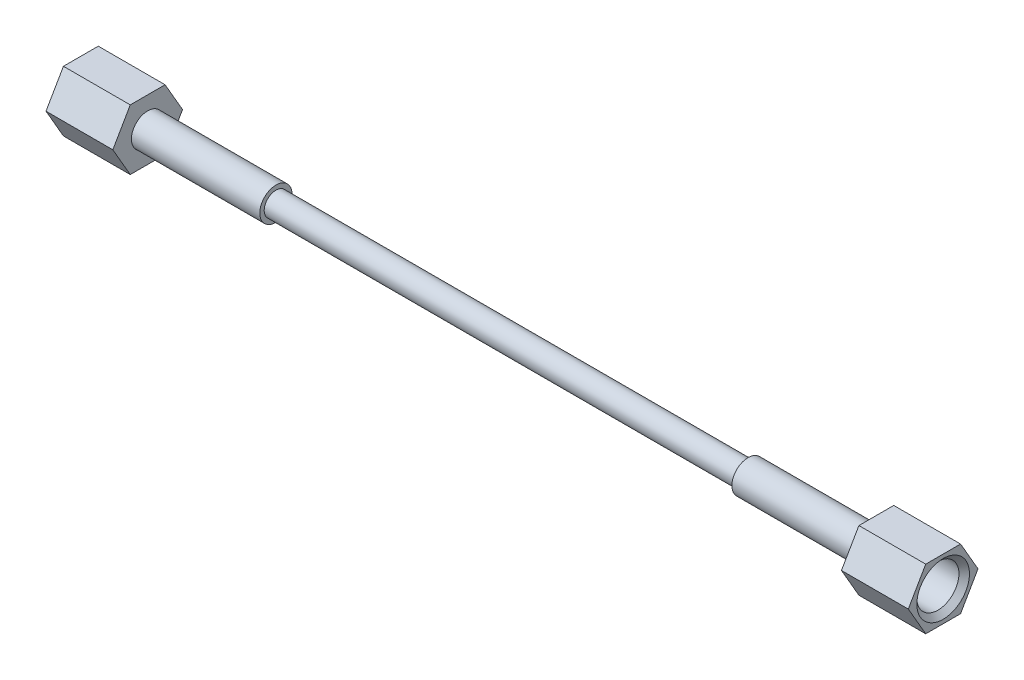
ISO-10303-21;
HEADER;
FILE_DESCRIPTION(('STEP AP214'),'2;1');
FILE_NAME('part.step','',(''),(''),'','','');
FILE_SCHEMA(('AUTOMOTIVE_DESIGN { 1 0 10303 214 1 1 1 1 }'));
ENDSEC;
DATA;
#1=APPLICATION_CONTEXT('core data for automotive mechanical design processes');
#2=APPLICATION_PROTOCOL_DEFINITION('international standard','automotive_design',2000,#1);
#3=PRODUCT_CONTEXT('',#1,'mechanical');
#4=PRODUCT('Part','Part','',(#3));
#5=PRODUCT_RELATED_PRODUCT_CATEGORY('part','',(#4));
#6=PRODUCT_DEFINITION_FORMATION('','',#4);
#7=PRODUCT_DEFINITION_CONTEXT('part definition',#1,'design');
#8=PRODUCT_DEFINITION('design','',#6,#7);
#9=PRODUCT_DEFINITION_SHAPE('','',#8);
#10=(LENGTH_UNIT() NAMED_UNIT(*) SI_UNIT(.MILLI.,.METRE.));
#11=(NAMED_UNIT(*) PLANE_ANGLE_UNIT() SI_UNIT($,.RADIAN.));
#12=(NAMED_UNIT(*) SI_UNIT($,.STERADIAN.) SOLID_ANGLE_UNIT());
#13=UNCERTAINTY_MEASURE_WITH_UNIT(LENGTH_MEASURE(1.E-05),#10,'distance_accuracy_value','');
#14=(GEOMETRIC_REPRESENTATION_CONTEXT(3) GLOBAL_UNCERTAINTY_ASSIGNED_CONTEXT((#13)) GLOBAL_UNIT_ASSIGNED_CONTEXT((#10,
#11,#12)) REPRESENTATION_CONTEXT('',''));
#15=CARTESIAN_POINT('',(0.,0.,0.));
#16=DIRECTION('',(0.,0.,1.));
#17=DIRECTION('',(1.,0.,0.));
#18=AXIS2_PLACEMENT_3D('',#15,#16,#17);
#19=CARTESIAN_POINT('',(-194.31,0.,-8.21223022895325));
#20=DIRECTION('',(0.,-0.500000000000001,0.866025403784438));
#21=DIRECTION('',(0.,-0.866025403784438,-0.500000000000001));
#22=AXIS2_PLACEMENT_3D('',#19,#20,#21);
#23=PLANE('',#22);
#24=DIRECTION('',(0.,0.866025403784438,0.500000000000001));
#25=VECTOR('',#24,1.);
#26=CARTESIAN_POINT('',(-178.562,0.,-8.21223022895325));
#27=LINE('',#26,#25);
#28=CARTESIAN_POINT('',(-178.562,0.,-8.21223022895325));
#29=VERTEX_POINT('',#28);
#30=CARTESIAN_POINT('',(-178.562,7.112,-4.10611511447662));
#31=VERTEX_POINT('',#30);
#32=EDGE_CURVE('E128',#29,#31,#27,.T.);
#33=ORIENTED_EDGE('',*,*,#32,.F.);
#34=DIRECTION('',(1.,0.,0.));
#35=VECTOR('',#34,1.);
#36=CARTESIAN_POINT('',(-194.31,0.,-8.21223022895325));
#37=LINE('',#36,#35);
#38=CARTESIAN_POINT('',(-194.31,0.,-8.21223022895325));
#39=VERTEX_POINT('',#38);
#40=EDGE_CURVE('E127',#39,#29,#37,.T.);
#41=ORIENTED_EDGE('',*,*,#40,.F.);
#42=DIRECTION('',(0.,0.866025403784438,0.500000000000001));
#43=VECTOR('',#42,1.);
#44=CARTESIAN_POINT('',(-194.31,0.,-8.21223022895325));
#45=LINE('',#44,#43);
#46=CARTESIAN_POINT('',(-194.31,7.112,-4.10611511447662));
#47=VERTEX_POINT('',#46);
#48=EDGE_CURVE('E141',#39,#47,#45,.T.);
#49=ORIENTED_EDGE('',*,*,#48,.T.);
#50=DIRECTION('',(1.,0.,0.));
#51=VECTOR('',#50,1.);
#52=CARTESIAN_POINT('',(-194.31,7.112,-4.10611511447662));
#53=LINE('',#52,#51);
#54=EDGE_CURVE('E148',#47,#31,#53,.T.);
#55=ORIENTED_EDGE('',*,*,#54,.T.);
#56=EDGE_LOOP('',(#33,#41,#49,#55));
#57=FACE_BOUND('',#56,.T.);
#58=ADVANCED_FACE('F44',(#57),#23,.F.);
#59=CARTESIAN_POINT('',(-194.31,7.112,-4.10611511447662));
#60=DIRECTION('',(0.,-1.,0.));
#61=DIRECTION('',(0.,0.,-1.));
#62=AXIS2_PLACEMENT_3D('',#59,#60,#61);
#63=PLANE('',#62);
#64=DIRECTION('',(0.,0.,1.));
#65=VECTOR('',#64,1.);
#66=CARTESIAN_POINT('',(-178.562,7.112,-4.10611511447662));
#67=LINE('',#66,#65);
#68=CARTESIAN_POINT('',(-178.562,7.112,4.10611511447661));
#69=VERTEX_POINT('',#68);
#70=EDGE_CURVE('E130',#31,#69,#67,.T.);
#71=ORIENTED_EDGE('',*,*,#70,.F.);
#72=ORIENTED_EDGE('',*,*,#54,.F.);
#73=DIRECTION('',(0.,0.,1.));
#74=VECTOR('',#73,1.);
#75=CARTESIAN_POINT('',(-194.31,7.112,-4.10611511447662));
#76=LINE('',#75,#74);
#77=CARTESIAN_POINT('',(-194.31,7.112,4.10611511447661));
#78=VERTEX_POINT('',#77);
#79=EDGE_CURVE('E93',#47,#78,#76,.T.);
#80=ORIENTED_EDGE('',*,*,#79,.T.);
#81=DIRECTION('',(1.,0.,0.));
#82=VECTOR('',#81,1.);
#83=CARTESIAN_POINT('',(-194.31,7.112,4.10611511447661));
#84=LINE('',#83,#82);
#85=EDGE_CURVE('E145',#78,#69,#84,.T.);
#86=ORIENTED_EDGE('',*,*,#85,.T.);
#87=EDGE_LOOP('',(#71,#72,#80,#86));
#88=FACE_BOUND('',#87,.T.);
#89=ADVANCED_FACE('F172',(#88),#63,.F.);
#90=CARTESIAN_POINT('',(-194.31,7.112,4.10611511447661));
#91=DIRECTION('',(0.,-0.500000000000001,-0.866025403784438));
#92=DIRECTION('',(0.,0.866025403784438,-0.500000000000001));
#93=AXIS2_PLACEMENT_3D('',#90,#91,#92);
#94=PLANE('',#93);
#95=DIRECTION('',(0.,-0.866025403784438,0.500000000000001));
#96=VECTOR('',#95,1.);
#97=CARTESIAN_POINT('',(-178.562,7.112,4.10611511447661));
#98=LINE('',#97,#96);
#99=CARTESIAN_POINT('',(-178.562,0.,8.21223022895324));
#100=VERTEX_POINT('',#99);
#101=EDGE_CURVE('E134',#69,#100,#98,.T.);
#102=ORIENTED_EDGE('',*,*,#101,.F.);
#103=ORIENTED_EDGE('',*,*,#85,.F.);
#104=DIRECTION('',(0.,-0.866025403784438,0.500000000000001));
#105=VECTOR('',#104,1.);
#106=CARTESIAN_POINT('',(-194.31,7.112,4.10611511447661));
#107=LINE('',#106,#105);
#108=CARTESIAN_POINT('',(-194.31,0.,8.21223022895324));
#109=VERTEX_POINT('',#108);
#110=EDGE_CURVE('E121',#78,#109,#107,.T.);
#111=ORIENTED_EDGE('',*,*,#110,.T.);
#112=DIRECTION('',(1.,0.,0.));
#113=VECTOR('',#112,1.);
#114=CARTESIAN_POINT('',(-194.31,0.,8.21223022895324));
#115=LINE('',#114,#113);
#116=EDGE_CURVE('E115',#109,#100,#115,.T.);
#117=ORIENTED_EDGE('',*,*,#116,.T.);
#118=EDGE_LOOP('',(#102,#103,#111,#117));
#119=FACE_BOUND('',#118,.T.);
#120=ADVANCED_FACE('F193',(#119),#94,.F.);
#121=CARTESIAN_POINT('',(-194.31,0.,8.21223022895324));
#122=DIRECTION('',(0.,0.500000000000001,-0.866025403784438));
#123=DIRECTION('',(0.,0.866025403784438,0.500000000000001));
#124=AXIS2_PLACEMENT_3D('',#121,#122,#123);
#125=PLANE('',#124);
#126=DIRECTION('',(0.,-0.866025403784438,-0.500000000000001));
#127=VECTOR('',#126,1.);
#128=CARTESIAN_POINT('',(-178.562,0.,8.21223022895324));
#129=LINE('',#128,#127);
#130=CARTESIAN_POINT('',(-178.562,-7.112,4.10611511447661));
#131=VERTEX_POINT('',#130);
#132=EDGE_CURVE('E137',#100,#131,#129,.T.);
#133=ORIENTED_EDGE('',*,*,#132,.F.);
#134=ORIENTED_EDGE('',*,*,#116,.F.);
#135=DIRECTION('',(0.,-0.866025403784438,-0.500000000000001));
#136=VECTOR('',#135,1.);
#137=CARTESIAN_POINT('',(-194.31,0.,8.21223022895324));
#138=LINE('',#137,#136);
#139=CARTESIAN_POINT('',(-194.31,-7.112,4.10611511447661));
#140=VERTEX_POINT('',#139);
#141=EDGE_CURVE('E105',#109,#140,#138,.T.);
#142=ORIENTED_EDGE('',*,*,#141,.T.);
#143=DIRECTION('',(1.,0.,0.));
#144=VECTOR('',#143,1.);
#145=CARTESIAN_POINT('',(-194.31,-7.112,4.10611511447661));
#146=LINE('',#145,#144);
#147=EDGE_CURVE('E110',#140,#131,#146,.T.);
#148=ORIENTED_EDGE('',*,*,#147,.T.);
#149=EDGE_LOOP('',(#133,#134,#142,#148));
#150=FACE_BOUND('',#149,.T.);
#151=ADVANCED_FACE('F118',(#150),#125,.F.);
#152=CARTESIAN_POINT('',(-194.31,-7.112,4.10611511447661));
#153=DIRECTION('',(0.,1.,0.));
#154=DIRECTION('',(0.,0.,1.));
#155=AXIS2_PLACEMENT_3D('',#152,#153,#154);
#156=PLANE('',#155);
#157=DIRECTION('',(0.,0.,-1.));
#158=VECTOR('',#157,1.);
#159=CARTESIAN_POINT('',(-178.562,-7.112,4.10611511447661));
#160=LINE('',#159,#158);
#161=CARTESIAN_POINT('',(-178.562,-7.112,-4.10611511447661));
#162=VERTEX_POINT('',#161);
#163=EDGE_CURVE('E112',#131,#162,#160,.T.);
#164=ORIENTED_EDGE('',*,*,#163,.F.);
#165=ORIENTED_EDGE('',*,*,#147,.F.);
#166=DIRECTION('',(0.,0.,-1.));
#167=VECTOR('',#166,1.);
#168=CARTESIAN_POINT('',(-194.31,-7.112,4.10611511447661));
#169=LINE('',#168,#167);
#170=CARTESIAN_POINT('',(-194.31,-7.112,-4.10611511447661));
#171=VERTEX_POINT('',#170);
#172=EDGE_CURVE('E101',#140,#171,#169,.T.);
#173=ORIENTED_EDGE('',*,*,#172,.T.);
#174=DIRECTION('',(1.,0.,0.));
#175=VECTOR('',#174,1.);
#176=CARTESIAN_POINT('',(-194.31,-7.112,-4.10611511447661));
#177=LINE('',#176,#175);
#178=EDGE_CURVE('E116',#171,#162,#177,.T.);
#179=ORIENTED_EDGE('',*,*,#178,.T.);
#180=EDGE_LOOP('',(#164,#165,#173,#179));
#181=FACE_BOUND('',#180,.T.);
#182=ADVANCED_FACE('F111',(#181),#156,.F.);
#183=CARTESIAN_POINT('',(-194.31,-7.112,-4.10611511447661));
#184=DIRECTION('',(0.,0.500000000000002,0.866025403784438));
#185=DIRECTION('',(0.,-0.866025403784438,0.500000000000001));
#186=AXIS2_PLACEMENT_3D('',#183,#184,#185);
#187=PLANE('',#186);
#188=DIRECTION('',(0.,0.866025403784438,-0.500000000000001));
#189=VECTOR('',#188,1.);
#190=CARTESIAN_POINT('',(-178.562,-7.112,-4.10611511447661));
#191=LINE('',#190,#189);
#192=EDGE_CURVE('E81',#162,#29,#191,.T.);
#193=ORIENTED_EDGE('',*,*,#192,.F.);
#194=ORIENTED_EDGE('',*,*,#178,.F.);
#195=DIRECTION('',(0.,0.866025403784438,-0.500000000000001));
#196=VECTOR('',#195,1.);
#197=CARTESIAN_POINT('',(-194.31,-7.112,-4.10611511447661));
#198=LINE('',#197,#196);
#199=EDGE_CURVE('E61',#171,#39,#198,.T.);
#200=ORIENTED_EDGE('',*,*,#199,.T.);
#201=ORIENTED_EDGE('',*,*,#40,.T.);
#202=EDGE_LOOP('',(#193,#194,#200,#201));
#203=FACE_BOUND('',#202,.T.);
#204=ADVANCED_FACE('F177',(#203),#187,.F.);
#205=CARTESIAN_POINT('',(-194.31,0.,-8.21223022895325));
#206=DIRECTION('',(1.,0.,0.));
#207=DIRECTION('',(0.,0.,1.));
#208=AXIS2_PLACEMENT_3D('',#205,#206,#207);
#209=PLANE('',#208);
#210=CARTESIAN_POINT('',(-194.31,0.,0.));
#211=DIRECTION('',(-1.,0.,0.));
#212=DIRECTION('',(0.,0.,1.));
#213=AXIS2_PLACEMENT_3D('',#210,#211,#212);
#214=CIRCLE('',#213,6.20077499999993);
#215=CARTESIAN_POINT('',(-194.31,0.,6.20077499999993));
#216=VERTEX_POINT('',#215);
#217=EDGE_CURVE('E12',#216,#216,#214,.T.);
#218=ORIENTED_EDGE('',*,*,#217,.F.);
#219=EDGE_LOOP('',(#218));
#220=FACE_BOUND('',#219,.T.);
#221=ORIENTED_EDGE('',*,*,#48,.F.);
#222=ORIENTED_EDGE('',*,*,#199,.F.);
#223=ORIENTED_EDGE('',*,*,#172,.F.);
#224=ORIENTED_EDGE('',*,*,#141,.F.);
#225=ORIENTED_EDGE('',*,*,#110,.F.);
#226=ORIENTED_EDGE('',*,*,#79,.F.);
#227=EDGE_LOOP('',(#221,#222,#223,#224,#225,#226));
#228=FACE_BOUND('',#227,.T.);
#229=ADVANCED_FACE('F103',(#220,#228),#209,.F.);
#230=CARTESIAN_POINT('',(-178.562,0.,-8.21223022895325));
#231=DIRECTION('',(1.,0.,0.));
#232=DIRECTION('',(0.,0.,1.));
#233=AXIS2_PLACEMENT_3D('',#230,#231,#232);
#234=PLANE('',#233);
#235=CARTESIAN_POINT('',(-178.562,0.,0.));
#236=DIRECTION('',(-1.,0.,0.));
#237=DIRECTION('',(0.,0.,1.));
#238=AXIS2_PLACEMENT_3D('',#235,#236,#237);
#239=CIRCLE('',#238,3.83540000000001);
#240=CARTESIAN_POINT('',(-178.562,0.,3.83540000000001));
#241=VERTEX_POINT('',#240);
#242=EDGE_CURVE('E131',#241,#241,#239,.T.);
#243=ORIENTED_EDGE('',*,*,#242,.T.);
#244=EDGE_LOOP('',(#243));
#245=FACE_BOUND('',#244,.T.);
#246=ORIENTED_EDGE('',*,*,#32,.T.);
#247=ORIENTED_EDGE('',*,*,#70,.T.);
#248=ORIENTED_EDGE('',*,*,#101,.T.);
#249=ORIENTED_EDGE('',*,*,#132,.T.);
#250=ORIENTED_EDGE('',*,*,#163,.T.);
#251=ORIENTED_EDGE('',*,*,#192,.T.);
#252=EDGE_LOOP('',(#246,#247,#248,#249,#250,#251));
#253=FACE_BOUND('',#252,.T.);
#254=ADVANCED_FACE('F184',(#245,#253),#234,.T.);
#255=CARTESIAN_POINT('',(-194.31,0.,0.));
#256=DIRECTION('',(-1.,0.,0.));
#257=DIRECTION('',(0.,0.,-1.));
#258=AXIS2_PLACEMENT_3D('',#255,#256,#257);
#259=CYLINDRICAL_SURFACE('',#258,3.83540000000001);
#260=CARTESIAN_POINT('',(-184.743899614258,0.,0.));
#261=DIRECTION('',(1.,0.,0.));
#262=DIRECTION('',(0.,0.,-1.));
#263=AXIS2_PLACEMENT_3D('',#260,#261,#262);
#264=CIRCLE('',#263,3.83540000000001);
#265=CARTESIAN_POINT('',(-184.743899614258,0.,-3.83540000000001));
#266=VERTEX_POINT('',#265);
#267=EDGE_CURVE('E163',#266,#266,#264,.T.);
#268=ORIENTED_EDGE('',*,*,#267,.F.);
#269=EDGE_LOOP('',(#268));
#270=FACE_BOUND('',#269,.T.);
#271=ORIENTED_EDGE('',*,*,#242,.F.);
#272=EDGE_LOOP('',(#271));
#273=FACE_BOUND('',#272,.T.);
#274=ADVANCED_FACE('F227',(#270,#273),#259,.F.);
#275=CARTESIAN_POINT('',(-185.42,0.,0.));
#276=DIRECTION('',(-1.,0.,0.));
#277=DIRECTION('',(0.,0.,-1.));
#278=AXIS2_PLACEMENT_3D('',#275,#276,#277);
#279=CONICAL_SURFACE('',#278,4.96062,1.02974425867667);
#280=ORIENTED_EDGE('',*,*,#267,.T.);
#281=EDGE_LOOP('',(#280));
#282=FACE_BOUND('',#281,.T.);
#283=CARTESIAN_POINT('',(-185.42,0.,0.));
#284=DIRECTION('',(1.,0.,0.));
#285=DIRECTION('',(0.,0.,-1.));
#286=AXIS2_PLACEMENT_3D('',#283,#284,#285);
#287=CIRCLE('',#286,4.96062);
#288=CARTESIAN_POINT('',(-185.42,0.,-4.96062));
#289=VERTEX_POINT('',#288);
#290=EDGE_CURVE('E161',#289,#289,#287,.T.);
#291=ORIENTED_EDGE('',*,*,#290,.F.);
#292=EDGE_LOOP('',(#291));
#293=FACE_BOUND('',#292,.T.);
#294=ADVANCED_FACE('F157',(#282,#293),#279,.F.);
#295=CARTESIAN_POINT('',(-194.31,0.,0.));
#296=DIRECTION('',(-1.,0.,0.));
#297=DIRECTION('',(0.,0.,-1.));
#298=AXIS2_PLACEMENT_3D('',#295,#296,#297);
#299=CYLINDRICAL_SURFACE('',#298,4.96062);
#300=CARTESIAN_POINT('',(-193.069845,0.,0.));
#301=DIRECTION('',(-1.,0.,0.));
#302=DIRECTION('',(0.,0.,1.));
#303=AXIS2_PLACEMENT_3D('',#300,#301,#302);
#304=CIRCLE('',#303,4.96062);
#305=CARTESIAN_POINT('',(-193.069845,0.,4.96062));
#306=VERTEX_POINT('',#305);
#307=EDGE_CURVE('E53',#306,#306,#304,.F.);
#308=ORIENTED_EDGE('',*,*,#307,.F.);
#309=EDGE_LOOP('',(#308));
#310=FACE_BOUND('',#309,.T.);
#311=ORIENTED_EDGE('',*,*,#290,.T.);
#312=EDGE_LOOP('',(#311));
#313=FACE_BOUND('',#312,.T.);
#314=ADVANCED_FACE('F154',(#310,#313),#299,.F.);
#315=CARTESIAN_POINT('',(-193.069845,0.,0.));
#316=DIRECTION('',(-1.,0.,0.));
#317=DIRECTION('',(0.,0.,-1.));
#318=AXIS2_PLACEMENT_3D('',#315,#316,#317);
#319=CONICAL_SURFACE('',#318,4.96062,0.785398163397451);
#320=ORIENTED_EDGE('',*,*,#217,.T.);
#321=EDGE_LOOP('',(#320));
#322=FACE_BOUND('',#321,.T.);
#323=ORIENTED_EDGE('',*,*,#307,.T.);
#324=EDGE_LOOP('',(#323));
#325=FACE_BOUND('',#324,.T.);
#326=ADVANCED_FACE('F46',(#322,#325),#319,.F.);
#327=CLOSED_SHELL('',(#58,#89,#120,#151,#182,#204,#229,#254,#274,#294,#314,#326));
#328=MANIFOLD_SOLID_BREP('B2',#327);
#329=CARTESIAN_POINT('',(-0.691362245465482,0.,0.));
#330=DIRECTION('',(-1.,0.,0.));
#331=DIRECTION('',(0.,0.,1.));
#332=AXIS2_PLACEMENT_3D('',#329,#330,#331);
#333=CYLINDRICAL_SURFACE('',#332,3.81);
#334=CARTESIAN_POINT('',(-0.691362245465465,0.,0.));
#335=DIRECTION('',(-1.,0.,0.));
#336=DIRECTION('',(0.,0.,1.));
#337=AXIS2_PLACEMENT_3D('',#334,#335,#336);
#338=CIRCLE('',#337,3.80999999999999);
#339=CARTESIAN_POINT('',(-0.691362245465465,0.,3.80999999999999));
#340=VERTEX_POINT('',#339);
#341=EDGE_CURVE('E323',#340,#340,#338,.T.);
#342=ORIENTED_EDGE('',*,*,#341,.T.);
#343=EDGE_LOOP('',(#342));
#344=FACE_BOUND('',#343,.T.);
#345=CARTESIAN_POINT('',(-37.084,0.,0.));
#346=DIRECTION('',(-1.,0.,0.));
#347=DIRECTION('',(0.,0.,1.));
#348=AXIS2_PLACEMENT_3D('',#345,#346,#347);
#349=CIRCLE('',#348,3.81);
#350=CARTESIAN_POINT('',(-37.084,0.,3.81));
#351=VERTEX_POINT('',#350);
#352=EDGE_CURVE('E43',#351,#351,#349,.T.);
#353=ORIENTED_EDGE('',*,*,#352,.F.);
#354=EDGE_LOOP('',(#353));
#355=FACE_BOUND('',#354,.T.);
#356=ADVANCED_FACE('F295',(#344,#355),#333,.T.);
#357=CARTESIAN_POINT('',(-37.084,2.76859999999997,0.));
#358=DIRECTION('',(-1.,0.,0.));
#359=DIRECTION('',(0.,0.,1.));
#360=AXIS2_PLACEMENT_3D('',#357,#358,#359);
#361=PLANE('',#360);
#362=ORIENTED_EDGE('',*,*,#352,.T.);
#363=EDGE_LOOP('',(#362));
#364=FACE_BOUND('',#363,.T.);
#365=CARTESIAN_POINT('',(-37.084,0.,0.));
#366=DIRECTION('',(-1.,0.,0.));
#367=DIRECTION('',(0.,0.,1.));
#368=AXIS2_PLACEMENT_3D('',#365,#366,#367);
#369=CIRCLE('',#368,2.76859999999997);
#370=CARTESIAN_POINT('',(-37.084,0.,2.76859999999997));
#371=VERTEX_POINT('',#370);
#372=EDGE_CURVE('E301',#371,#371,#369,.T.);
#373=ORIENTED_EDGE('',*,*,#372,.F.);
#374=EDGE_LOOP('',(#373));
#375=FACE_BOUND('',#374,.T.);
#376=ADVANCED_FACE('F341',(#364,#375),#361,.T.);
#377=CARTESIAN_POINT('',(-0.691362245465482,0.,0.));
#378=DIRECTION('',(-1.,0.,0.));
#379=DIRECTION('',(0.,0.,1.));
#380=AXIS2_PLACEMENT_3D('',#377,#378,#379);
#381=CYLINDRICAL_SURFACE('',#380,2.76859999999998);
#382=ORIENTED_EDGE('',*,*,#372,.T.);
#383=EDGE_LOOP('',(#382));
#384=FACE_BOUND('',#383,.T.);
#385=CARTESIAN_POINT('',(-148.336,0.,0.));
#386=DIRECTION('',(-1.,0.,0.));
#387=DIRECTION('',(0.,0.,1.));
#388=AXIS2_PLACEMENT_3D('',#385,#386,#387);
#389=CIRCLE('',#388,2.76859999999998);
#390=CARTESIAN_POINT('',(-148.336,0.,2.76859999999998));
#391=VERTEX_POINT('',#390);
#392=EDGE_CURVE('E305',#391,#391,#389,.T.);
#393=ORIENTED_EDGE('',*,*,#392,.F.);
#394=EDGE_LOOP('',(#393));
#395=FACE_BOUND('',#394,.T.);
#396=ADVANCED_FACE('F345',(#384,#395),#381,.T.);
#397=CARTESIAN_POINT('',(-148.336,2.76859999999998,0.));
#398=DIRECTION('',(1.,0.,0.));
#399=DIRECTION('',(0.,0.,-1.));
#400=AXIS2_PLACEMENT_3D('',#397,#398,#399);
#401=PLANE('',#400);
#402=ORIENTED_EDGE('',*,*,#392,.T.);
#403=EDGE_LOOP('',(#402));
#404=FACE_BOUND('',#403,.T.);
#405=CARTESIAN_POINT('',(-148.336,0.,0.));
#406=DIRECTION('',(-1.,0.,0.));
#407=DIRECTION('',(0.,0.,1.));
#408=AXIS2_PLACEMENT_3D('',#405,#406,#407);
#409=CIRCLE('',#408,3.81000000000001);
#410=CARTESIAN_POINT('',(-148.336,0.,3.81000000000001));
#411=VERTEX_POINT('',#410);
#412=EDGE_CURVE('E309',#411,#411,#409,.T.);
#413=ORIENTED_EDGE('',*,*,#412,.F.);
#414=EDGE_LOOP('',(#413));
#415=FACE_BOUND('',#414,.T.);
#416=ADVANCED_FACE('F349',(#404,#415),#401,.T.);
#417=CARTESIAN_POINT('',(-0.691362245465482,0.,0.));
#418=DIRECTION('',(-1.,0.,0.));
#419=DIRECTION('',(0.,0.,1.));
#420=AXIS2_PLACEMENT_3D('',#417,#418,#419);
#421=CYLINDRICAL_SURFACE('',#420,3.81000000000001);
#422=ORIENTED_EDGE('',*,*,#412,.T.);
#423=EDGE_LOOP('',(#422));
#424=FACE_BOUND('',#423,.T.);
#425=CARTESIAN_POINT('',(-184.728637754535,0.,0.));
#426=DIRECTION('',(-1.,0.,0.));
#427=DIRECTION('',(0.,0.,1.));
#428=AXIS2_PLACEMENT_3D('',#425,#426,#427);
#429=CIRCLE('',#428,3.81000000000002);
#430=CARTESIAN_POINT('',(-184.728637754535,0.,3.81000000000002));
#431=VERTEX_POINT('',#430);
#432=EDGE_CURVE('E314',#431,#431,#429,.T.);
#433=ORIENTED_EDGE('',*,*,#432,.F.);
#434=EDGE_LOOP('',(#433));
#435=FACE_BOUND('',#434,.T.);
#436=ADVANCED_FACE('F355',(#424,#435),#421,.T.);
#437=CARTESIAN_POINT('',(-183.034571325248,0.,0.));
#438=DIRECTION('',(-1.,0.,0.));
#439=DIRECTION('',(0.,0.,1.));
#440=AXIS2_PLACEMENT_3D('',#437,#438,#439);
#441=CONICAL_SURFACE('',#440,0.990600000000002,1.02974425867667);
#442=ORIENTED_EDGE('',*,*,#432,.T.);
#443=EDGE_LOOP('',(#442));
#444=FACE_BOUND('',#443,.T.);
#445=CARTESIAN_POINT('',(-183.034571325248,0.,0.));
#446=DIRECTION('',(-1.,0.,0.));
#447=DIRECTION('',(0.,0.,1.));
#448=AXIS2_PLACEMENT_3D('',#445,#446,#447);
#449=CIRCLE('',#448,0.990600000000002);
#450=CARTESIAN_POINT('',(-183.034571325248,0.,0.990600000000002));
#451=VERTEX_POINT('',#450);
#452=EDGE_CURVE('E317',#451,#451,#449,.T.);
#453=ORIENTED_EDGE('',*,*,#452,.F.);
#454=EDGE_LOOP('',(#453));
#455=FACE_BOUND('',#454,.T.);
#456=ADVANCED_FACE('F337',(#444,#455),#441,.F.);
#457=CARTESIAN_POINT('',(-0.691362245465482,0.,0.));
#458=DIRECTION('',(-1.,0.,0.));
#459=DIRECTION('',(0.,0.,1.));
#460=AXIS2_PLACEMENT_3D('',#457,#458,#459);
#461=CYLINDRICAL_SURFACE('',#460,0.990599999999991);
#462=ORIENTED_EDGE('',*,*,#452,.T.);
#463=EDGE_LOOP('',(#462));
#464=FACE_BOUND('',#463,.T.);
#465=CARTESIAN_POINT('',(-2.38542867475171,0.,0.));
#466=DIRECTION('',(-1.,0.,0.));
#467=DIRECTION('',(0.,0.,1.));
#468=AXIS2_PLACEMENT_3D('',#465,#466,#467);
#469=CIRCLE('',#468,0.99059999999998);
#470=CARTESIAN_POINT('',(-2.38542867475171,0.,0.99059999999998));
#471=VERTEX_POINT('',#470);
#472=EDGE_CURVE('E320',#471,#471,#469,.T.);
#473=ORIENTED_EDGE('',*,*,#472,.F.);
#474=EDGE_LOOP('',(#473));
#475=FACE_BOUND('',#474,.T.);
#476=ADVANCED_FACE('F331',(#464,#475),#461,.F.);
#477=CARTESIAN_POINT('',(-0.691362245465465,0.,0.));
#478=DIRECTION('',(1.,0.,0.));
#479=DIRECTION('',(0.,0.,-1.));
#480=AXIS2_PLACEMENT_3D('',#477,#478,#479);
#481=CONICAL_SURFACE('',#480,3.80999999999999,1.02974425867667);
#482=ORIENTED_EDGE('',*,*,#472,.T.);
#483=EDGE_LOOP('',(#482));
#484=FACE_BOUND('',#483,.T.);
#485=ORIENTED_EDGE('',*,*,#341,.F.);
#486=EDGE_LOOP('',(#485));
#487=FACE_BOUND('',#486,.T.);
#488=ADVANCED_FACE('F329',(#484,#487),#481,.F.);
#489=CLOSED_SHELL('',(#356,#376,#396,#416,#436,#456,#476,#488));
#490=MANIFOLD_SOLID_BREP('B6',#489);
#491=CARTESIAN_POINT('',(8.89,0.,-8.21223022895325));
#492=DIRECTION('',(0.,-0.500000000000001,0.866025403784438));
#493=DIRECTION('',(0.,-0.866025403784438,-0.500000000000001));
#494=AXIS2_PLACEMENT_3D('',#491,#492,#493);
#495=PLANE('',#494);
#496=DIRECTION('',(0.,0.866025403784438,0.500000000000001));
#497=VECTOR('',#496,1.);
#498=CARTESIAN_POINT('',(-6.858,0.,-8.21223022895325));
#499=LINE('',#498,#497);
#500=CARTESIAN_POINT('',(-6.858,0.,-8.21223022895325));
#501=VERTEX_POINT('',#500);
#502=CARTESIAN_POINT('',(-6.858,7.112,-4.10611511447662));
#503=VERTEX_POINT('',#502);
#504=EDGE_CURVE('E503',#501,#503,#499,.T.);
#505=ORIENTED_EDGE('',*,*,#504,.T.);
#506=DIRECTION('',(-1.,0.,0.));
#507=VECTOR('',#506,1.);
#508=CARTESIAN_POINT('',(8.89,7.112,-4.10611511447662));
#509=LINE('',#508,#507);
#510=CARTESIAN_POINT('',(8.89,7.112,-4.10611511447662));
#511=VERTEX_POINT('',#510);
#512=EDGE_CURVE('E521',#511,#503,#509,.T.);
#513=ORIENTED_EDGE('',*,*,#512,.F.);
#514=DIRECTION('',(0.,0.866025403784438,0.500000000000001));
#515=VECTOR('',#514,1.);
#516=CARTESIAN_POINT('',(8.89,0.,-8.21223022895325));
#517=LINE('',#516,#515);
#518=CARTESIAN_POINT('',(8.89,0.,-8.21223022895325));
#519=VERTEX_POINT('',#518);
#520=EDGE_CURVE('E514',#519,#511,#517,.T.);
#521=ORIENTED_EDGE('',*,*,#520,.F.);
#522=DIRECTION('',(-1.,0.,0.));
#523=VECTOR('',#522,1.);
#524=CARTESIAN_POINT('',(8.89,0.,-8.21223022895325));
#525=LINE('',#524,#523);
#526=EDGE_CURVE('E499',#519,#501,#525,.T.);
#527=ORIENTED_EDGE('',*,*,#526,.T.);
#528=EDGE_LOOP('',(#505,#513,#521,#527));
#529=FACE_BOUND('',#528,.T.);
#530=ADVANCED_FACE('F417',(#529),#495,.F.);
#531=CARTESIAN_POINT('',(8.89,7.112,-4.10611511447662));
#532=DIRECTION('',(0.,-1.,0.));
#533=DIRECTION('',(0.,0.,-1.));
#534=AXIS2_PLACEMENT_3D('',#531,#532,#533);
#535=PLANE('',#534);
#536=DIRECTION('',(0.,0.,1.));
#537=VECTOR('',#536,1.);
#538=CARTESIAN_POINT('',(-6.858,7.112,-4.10611511447662));
#539=LINE('',#538,#537);
#540=CARTESIAN_POINT('',(-6.858,7.112,4.10611511447661));
#541=VERTEX_POINT('',#540);
#542=EDGE_CURVE('E506',#503,#541,#539,.T.);
#543=ORIENTED_EDGE('',*,*,#542,.T.);
#544=DIRECTION('',(-1.,0.,0.));
#545=VECTOR('',#544,1.);
#546=CARTESIAN_POINT('',(8.89,7.112,4.10611511447661));
#547=LINE('',#546,#545);
#548=CARTESIAN_POINT('',(8.89,7.112,4.10611511447661));
#549=VERTEX_POINT('',#548);
#550=EDGE_CURVE('E518',#549,#541,#547,.T.);
#551=ORIENTED_EDGE('',*,*,#550,.F.);
#552=DIRECTION('',(0.,0.,1.));
#553=VECTOR('',#552,1.);
#554=CARTESIAN_POINT('',(8.89,7.112,-4.10611511447662));
#555=LINE('',#554,#553);
#556=EDGE_CURVE('E472',#511,#549,#555,.T.);
#557=ORIENTED_EDGE('',*,*,#556,.F.);
#558=ORIENTED_EDGE('',*,*,#512,.T.);
#559=EDGE_LOOP('',(#543,#551,#557,#558));
#560=FACE_BOUND('',#559,.T.);
#561=ADVANCED_FACE('F537',(#560),#535,.F.);
#562=CARTESIAN_POINT('',(8.89,7.112,4.10611511447661));
#563=DIRECTION('',(0.,-0.500000000000001,-0.866025403784438));
#564=DIRECTION('',(0.,0.866025403784438,-0.500000000000001));
#565=AXIS2_PLACEMENT_3D('',#562,#563,#564);
#566=PLANE('',#565);
#567=DIRECTION('',(0.,-0.866025403784438,0.500000000000001));
#568=VECTOR('',#567,1.);
#569=CARTESIAN_POINT('',(-6.858,7.112,4.10611511447661));
#570=LINE('',#569,#568);
#571=CARTESIAN_POINT('',(-6.858,0.,8.21223022895324));
#572=VERTEX_POINT('',#571);
#573=EDGE_CURVE('E509',#541,#572,#570,.T.);
#574=ORIENTED_EDGE('',*,*,#573,.T.);
#575=DIRECTION('',(-1.,0.,0.));
#576=VECTOR('',#575,1.);
#577=CARTESIAN_POINT('',(8.89,0.,8.21223022895324));
#578=LINE('',#577,#576);
#579=CARTESIAN_POINT('',(8.89,0.,8.21223022895324));
#580=VERTEX_POINT('',#579);
#581=EDGE_CURVE('E494',#580,#572,#578,.T.);
#582=ORIENTED_EDGE('',*,*,#581,.F.);
#583=DIRECTION('',(0.,-0.866025403784438,0.500000000000001));
#584=VECTOR('',#583,1.);
#585=CARTESIAN_POINT('',(8.89,7.112,4.10611511447661));
#586=LINE('',#585,#584);
#587=EDGE_CURVE('E485',#549,#580,#586,.T.);
#588=ORIENTED_EDGE('',*,*,#587,.F.);
#589=ORIENTED_EDGE('',*,*,#550,.T.);
#590=EDGE_LOOP('',(#574,#582,#588,#589));
#591=FACE_BOUND('',#590,.T.);
#592=ADVANCED_FACE('F542',(#591),#566,.F.);
#593=CARTESIAN_POINT('',(8.89,0.,8.21223022895324));
#594=DIRECTION('',(0.,0.500000000000001,-0.866025403784438));
#595=DIRECTION('',(0.,0.866025403784438,0.500000000000001));
#596=AXIS2_PLACEMENT_3D('',#593,#594,#595);
#597=PLANE('',#596);
#598=DIRECTION('',(0.,-0.866025403784438,-0.500000000000001));
#599=VECTOR('',#598,1.);
#600=CARTESIAN_POINT('',(-6.858,0.,8.21223022895324));
#601=LINE('',#600,#599);
#602=CARTESIAN_POINT('',(-6.858,-7.112,4.10611511447661));
#603=VERTEX_POINT('',#602);
#604=EDGE_CURVE('E493',#572,#603,#601,.T.);
#605=ORIENTED_EDGE('',*,*,#604,.T.);
#606=DIRECTION('',(-1.,0.,0.));
#607=VECTOR('',#606,1.);
#608=CARTESIAN_POINT('',(8.89,-7.112,4.10611511447661));
#609=LINE('',#608,#607);
#610=CARTESIAN_POINT('',(8.89,-7.112,4.10611511447661));
#611=VERTEX_POINT('',#610);
#612=EDGE_CURVE('E490',#611,#603,#609,.T.);
#613=ORIENTED_EDGE('',*,*,#612,.F.);
#614=DIRECTION('',(0.,-0.866025403784438,-0.500000000000001));
#615=VECTOR('',#614,1.);
#616=CARTESIAN_POINT('',(8.89,0.,8.21223022895324));
#617=LINE('',#616,#615);
#618=EDGE_CURVE('E479',#580,#611,#617,.T.);
#619=ORIENTED_EDGE('',*,*,#618,.F.);
#620=ORIENTED_EDGE('',*,*,#581,.T.);
#621=EDGE_LOOP('',(#605,#613,#619,#620));
#622=FACE_BOUND('',#621,.T.);
#623=ADVANCED_FACE('F491',(#622),#597,.F.);
#624=CARTESIAN_POINT('',(8.89,-7.112,4.10611511447661));
#625=DIRECTION('',(0.,1.,0.));
#626=DIRECTION('',(0.,0.,1.));
#627=AXIS2_PLACEMENT_3D('',#624,#625,#626);
#628=PLANE('',#627);
#629=DIRECTION('',(0.,0.,-1.));
#630=VECTOR('',#629,1.);
#631=CARTESIAN_POINT('',(-6.858,-7.112,4.10611511447661));
#632=LINE('',#631,#630);
#633=CARTESIAN_POINT('',(-6.858,-7.112,-4.10611511447661));
#634=VERTEX_POINT('',#633);
#635=EDGE_CURVE('E457',#603,#634,#632,.T.);
#636=ORIENTED_EDGE('',*,*,#635,.T.);
#637=DIRECTION('',(-1.,0.,0.));
#638=VECTOR('',#637,1.);
#639=CARTESIAN_POINT('',(8.89,-7.112,-4.10611511447661));
#640=LINE('',#639,#638);
#641=CARTESIAN_POINT('',(8.89,-7.112,-4.10611511447661));
#642=VERTEX_POINT('',#641);
#643=EDGE_CURVE('E495',#642,#634,#640,.T.);
#644=ORIENTED_EDGE('',*,*,#643,.F.);
#645=DIRECTION('',(0.,0.,-1.));
#646=VECTOR('',#645,1.);
#647=CARTESIAN_POINT('',(8.89,-7.112,4.10611511447661));
#648=LINE('',#647,#646);
#649=EDGE_CURVE('E483',#611,#642,#648,.T.);
#650=ORIENTED_EDGE('',*,*,#649,.F.);
#651=ORIENTED_EDGE('',*,*,#612,.T.);
#652=EDGE_LOOP('',(#636,#644,#650,#651));
#653=FACE_BOUND('',#652,.T.);
#654=ADVANCED_FACE('F497',(#653),#628,.F.);
#655=CARTESIAN_POINT('',(8.89,-7.112,-4.10611511447661));
#656=DIRECTION('',(0.,0.500000000000002,0.866025403784438));
#657=DIRECTION('',(0.,-0.866025403784438,0.500000000000001));
#658=AXIS2_PLACEMENT_3D('',#655,#656,#657);
#659=PLANE('',#658);
#660=DIRECTION('',(0.,0.866025403784438,-0.500000000000001));
#661=VECTOR('',#660,1.);
#662=CARTESIAN_POINT('',(-6.858,-7.112,-4.10611511447661));
#663=LINE('',#662,#661);
#664=EDGE_CURVE('E463',#634,#501,#663,.T.);
#665=ORIENTED_EDGE('',*,*,#664,.T.);
#666=ORIENTED_EDGE('',*,*,#526,.F.);
#667=DIRECTION('',(0.,0.866025403784438,-0.500000000000001));
#668=VECTOR('',#667,1.);
#669=CARTESIAN_POINT('',(8.89,-7.112,-4.10611511447661));
#670=LINE('',#669,#668);
#671=EDGE_CURVE('E434',#642,#519,#670,.T.);
#672=ORIENTED_EDGE('',*,*,#671,.F.);
#673=ORIENTED_EDGE('',*,*,#643,.T.);
#674=EDGE_LOOP('',(#665,#666,#672,#673));
#675=FACE_BOUND('',#674,.T.);
#676=ADVANCED_FACE('F552',(#675),#659,.F.);
#677=CARTESIAN_POINT('',(8.89,0.,-8.21223022895325));
#678=DIRECTION('',(-1.,0.,0.));
#679=DIRECTION('',(0.,0.,1.));
#680=AXIS2_PLACEMENT_3D('',#677,#678,#679);
#681=PLANE('',#680);
#682=CARTESIAN_POINT('',(8.89,0.,0.));
#683=DIRECTION('',(-1.,0.,0.));
#684=DIRECTION('',(0.,0.,1.));
#685=AXIS2_PLACEMENT_3D('',#682,#683,#684);
#686=CIRCLE('',#685,6.20077499999993);
#687=CARTESIAN_POINT('',(8.89,0.,6.20077499999993));
#688=VERTEX_POINT('',#687);
#689=EDGE_CURVE('E293',#688,#688,#686,.T.);
#690=ORIENTED_EDGE('',*,*,#689,.T.);
#691=EDGE_LOOP('',(#690));
#692=FACE_BOUND('',#691,.T.);
#693=ORIENTED_EDGE('',*,*,#520,.T.);
#694=ORIENTED_EDGE('',*,*,#556,.T.);
#695=ORIENTED_EDGE('',*,*,#587,.T.);
#696=ORIENTED_EDGE('',*,*,#618,.T.);
#697=ORIENTED_EDGE('',*,*,#649,.T.);
#698=ORIENTED_EDGE('',*,*,#671,.T.);
#699=EDGE_LOOP('',(#693,#694,#695,#696,#697,#698));
#700=FACE_BOUND('',#699,.T.);
#701=ADVANCED_FACE('F481',(#692,#700),#681,.F.);
#702=CARTESIAN_POINT('',(-6.858,0.,-8.21223022895325));
#703=DIRECTION('',(-1.,0.,0.));
#704=DIRECTION('',(0.,0.,1.));
#705=AXIS2_PLACEMENT_3D('',#702,#703,#704);
#706=PLANE('',#705);
#707=CARTESIAN_POINT('',(-6.858,0.,0.));
#708=DIRECTION('',(-1.,0.,0.));
#709=DIRECTION('',(0.,0.,1.));
#710=AXIS2_PLACEMENT_3D('',#707,#708,#709);
#711=CIRCLE('',#710,3.83540000000001);
#712=CARTESIAN_POINT('',(-6.858,0.,3.83540000000001));
#713=VERTEX_POINT('',#712);
#714=EDGE_CURVE('E507',#713,#713,#711,.T.);
#715=ORIENTED_EDGE('',*,*,#714,.F.);
#716=EDGE_LOOP('',(#715));
#717=FACE_BOUND('',#716,.T.);
#718=ORIENTED_EDGE('',*,*,#504,.F.);
#719=ORIENTED_EDGE('',*,*,#664,.F.);
#720=ORIENTED_EDGE('',*,*,#635,.F.);
#721=ORIENTED_EDGE('',*,*,#604,.F.);
#722=ORIENTED_EDGE('',*,*,#573,.F.);
#723=ORIENTED_EDGE('',*,*,#542,.F.);
#724=EDGE_LOOP('',(#718,#719,#720,#721,#722,#723));
#725=FACE_BOUND('',#724,.T.);
#726=ADVANCED_FACE('F555',(#717,#725),#706,.T.);
#727=CARTESIAN_POINT('',(8.89,0.,0.));
#728=DIRECTION('',(1.,0.,0.));
#729=DIRECTION('',(0.,0.,-1.));
#730=AXIS2_PLACEMENT_3D('',#727,#728,#729);
#731=CYLINDRICAL_SURFACE('',#730,3.83540000000001);
#732=CARTESIAN_POINT('',(-0.676100385742156,0.,0.));
#733=DIRECTION('',(1.,0.,0.));
#734=DIRECTION('',(0.,0.,-1.));
#735=AXIS2_PLACEMENT_3D('',#732,#733,#734);
#736=CIRCLE('',#735,3.83540000000001);
#737=CARTESIAN_POINT('',(-0.676100385742156,0.,-3.83540000000001));
#738=VERTEX_POINT('',#737);
#739=EDGE_CURVE('E573',#738,#738,#736,.T.);
#740=ORIENTED_EDGE('',*,*,#739,.T.);
#741=EDGE_LOOP('',(#740));
#742=FACE_BOUND('',#741,.T.);
#743=ORIENTED_EDGE('',*,*,#714,.T.);
#744=EDGE_LOOP('',(#743));
#745=FACE_BOUND('',#744,.T.);
#746=ADVANCED_FACE('F558',(#742,#745),#731,.F.);
#747=CARTESIAN_POINT('',(0.,0.,0.));
#748=DIRECTION('',(1.,0.,0.));
#749=DIRECTION('',(0.,0.,-1.));
#750=AXIS2_PLACEMENT_3D('',#747,#748,#749);
#751=CONICAL_SURFACE('',#750,4.96062,1.02974425867667);
#752=ORIENTED_EDGE('',*,*,#739,.F.);
#753=EDGE_LOOP('',(#752));
#754=FACE_BOUND('',#753,.T.);
#755=CARTESIAN_POINT('',(0.,0.,0.));
#756=DIRECTION('',(1.,0.,0.));
#757=DIRECTION('',(0.,0.,-1.));
#758=AXIS2_PLACEMENT_3D('',#755,#756,#757);
#759=CIRCLE('',#758,4.96062);
#760=CARTESIAN_POINT('',(0.,0.,-4.96062));
#761=VERTEX_POINT('',#760);
#762=EDGE_CURVE('E576',#761,#761,#759,.T.);
#763=ORIENTED_EDGE('',*,*,#762,.T.);
#764=EDGE_LOOP('',(#763));
#765=FACE_BOUND('',#764,.T.);
#766=ADVANCED_FACE('F533',(#754,#765),#751,.F.);
#767=CARTESIAN_POINT('',(8.89,0.,0.));
#768=DIRECTION('',(1.,0.,0.));
#769=DIRECTION('',(0.,0.,-1.));
#770=AXIS2_PLACEMENT_3D('',#767,#768,#769);
#771=CYLINDRICAL_SURFACE('',#770,4.96062);
#772=CARTESIAN_POINT('',(7.64984500000008,0.,0.));
#773=DIRECTION('',(-1.,0.,0.));
#774=DIRECTION('',(0.,0.,1.));
#775=AXIS2_PLACEMENT_3D('',#772,#773,#774);
#776=CIRCLE('',#775,4.96062);
#777=CARTESIAN_POINT('',(7.64984500000008,0.,4.96062));
#778=VERTEX_POINT('',#777);
#779=EDGE_CURVE('E426',#778,#778,#776,.F.);
#780=ORIENTED_EDGE('',*,*,#779,.T.);
#781=EDGE_LOOP('',(#780));
#782=FACE_BOUND('',#781,.T.);
#783=ORIENTED_EDGE('',*,*,#762,.F.);
#784=EDGE_LOOP('',(#783));
#785=FACE_BOUND('',#784,.T.);
#786=ADVANCED_FACE('F525',(#782,#785),#771,.F.);
#787=CARTESIAN_POINT('',(7.64984500000008,0.,0.));
#788=DIRECTION('',(1.,0.,0.));
#789=DIRECTION('',(0.,0.,-1.));
#790=AXIS2_PLACEMENT_3D('',#787,#788,#789);
#791=CONICAL_SURFACE('',#790,4.96062,0.785398163397451);
#792=ORIENTED_EDGE('',*,*,#689,.F.);
#793=EDGE_LOOP('',(#792));
#794=FACE_BOUND('',#793,.T.);
#795=ORIENTED_EDGE('',*,*,#779,.F.);
#796=EDGE_LOOP('',(#795));
#797=FACE_BOUND('',#796,.T.);
#798=ADVANCED_FACE('F419',(#794,#797),#791,.F.);
#799=CLOSED_SHELL('',(#530,#561,#592,#623,#654,#676,#701,#726,#746,#766,#786,#798));
#800=MANIFOLD_SOLID_BREP('B38',#799);
#801=ADVANCED_BREP_SHAPE_REPRESENTATION('',(#18,#328,#490,#800),#14);
#802=SHAPE_DEFINITION_REPRESENTATION(#9,#801);
ENDSEC;
END-ISO-10303-21;
